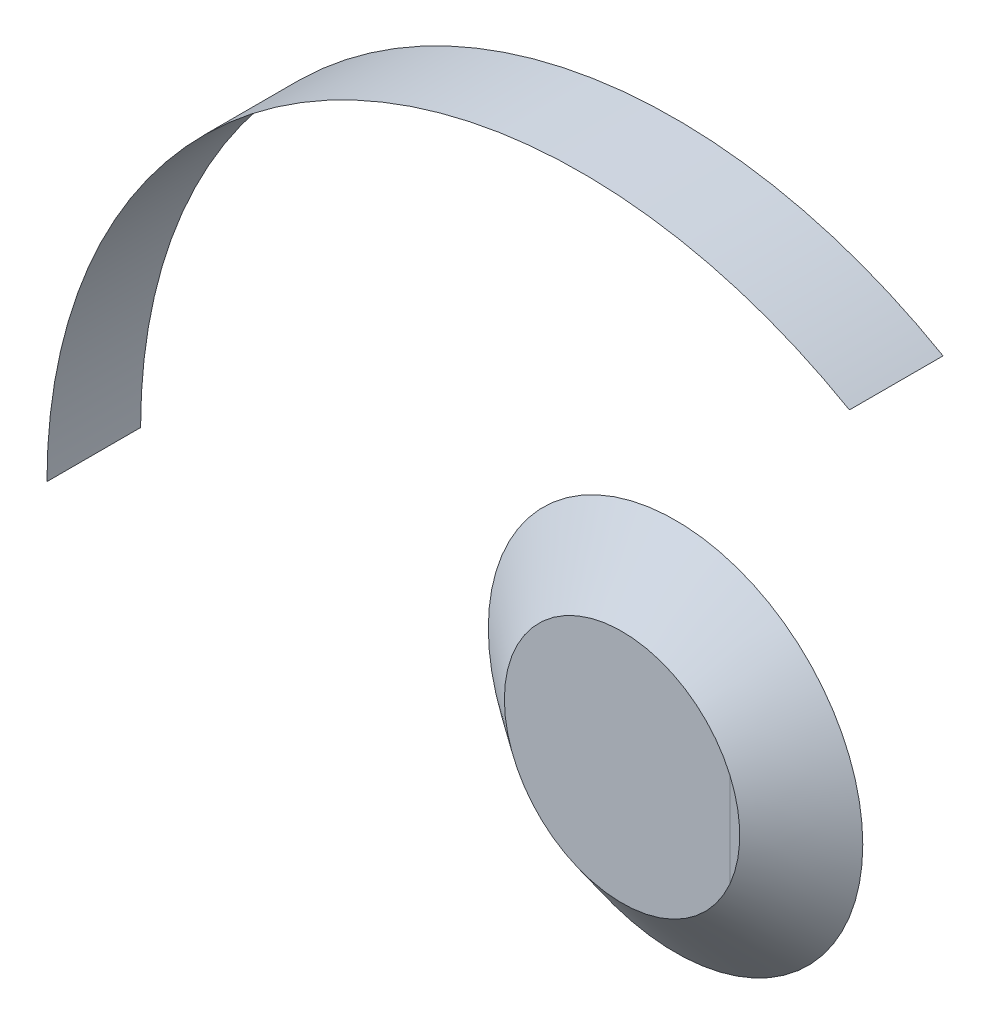
ISO-10303-21;
HEADER;
FILE_DESCRIPTION(('STEP AP214'),'2;1');
FILE_NAME('part.step','',(''),(''),'','','');
FILE_SCHEMA(('AUTOMOTIVE_DESIGN { 1 0 10303 214 1 1 1 1 }'));
ENDSEC;
DATA;
#1=APPLICATION_CONTEXT('core data for automotive mechanical design processes');
#2=APPLICATION_PROTOCOL_DEFINITION('international standard','automotive_design',2000,#1);
#3=PRODUCT_CONTEXT('',#1,'mechanical');
#4=PRODUCT('Part','Part','',(#3));
#5=PRODUCT_RELATED_PRODUCT_CATEGORY('part','',(#4));
#6=PRODUCT_DEFINITION_FORMATION('','',#4);
#7=PRODUCT_DEFINITION_CONTEXT('part definition',#1,'design');
#8=PRODUCT_DEFINITION('design','',#6,#7);
#9=PRODUCT_DEFINITION_SHAPE('','',#8);
#10=(LENGTH_UNIT() NAMED_UNIT(*) SI_UNIT(.MILLI.,.METRE.));
#11=(NAMED_UNIT(*) PLANE_ANGLE_UNIT() SI_UNIT($,.RADIAN.));
#12=(NAMED_UNIT(*) SI_UNIT($,.STERADIAN.) SOLID_ANGLE_UNIT());
#13=UNCERTAINTY_MEASURE_WITH_UNIT(LENGTH_MEASURE(1.E-05),#10,'distance_accuracy_value','');
#14=(GEOMETRIC_REPRESENTATION_CONTEXT(3) GLOBAL_UNCERTAINTY_ASSIGNED_CONTEXT((#13)) GLOBAL_UNIT_ASSIGNED_CONTEXT((#10,
#11,#12)) REPRESENTATION_CONTEXT('',''));
#15=CARTESIAN_POINT('',(0.,0.,0.));
#16=DIRECTION('',(0.,0.,1.));
#17=DIRECTION('',(1.,0.,0.));
#18=AXIS2_PLACEMENT_3D('',#15,#16,#17);
#19=CARTESIAN_POINT('',(0.,0.,0.));
#20=DIRECTION('',(0.,0.,1.));
#21=DIRECTION('',(1.,0.,0.));
#22=AXIS2_PLACEMENT_3D('',#19,#20,#21);
#23=CYLINDRICAL_SURFACE('',#22,200.);
#24=CARTESIAN_POINT('',(0.,0.,35.));
#25=DIRECTION('',(0.,0.,-1.));
#26=DIRECTION('',(-1.,0.,0.));
#27=AXIS2_PLACEMENT_3D('',#24,#25,#26);
#28=CIRCLE('',#27,200.);
#29=CARTESIAN_POINT('',(-200.,0.,35.));
#30=VERTEX_POINT('',#29);
#31=CARTESIAN_POINT('',(100.000000000001,173.205080756887,35.));
#32=VERTEX_POINT('',#31);
#33=EDGE_CURVE('E70',#30,#32,#28,.T.);
#34=ORIENTED_EDGE('',*,*,#33,.F.);
#35=DIRECTION('',(0.,0.,1.));
#36=VECTOR('',#35,1.);
#37=CARTESIAN_POINT('',(-200.,0.,0.));
#38=LINE('',#37,#36);
#39=CARTESIAN_POINT('',(-200.,0.,0.));
#40=VERTEX_POINT('',#39);
#41=EDGE_CURVE('E52',#40,#30,#38,.T.);
#42=ORIENTED_EDGE('',*,*,#41,.F.);
#43=CARTESIAN_POINT('',(0.,0.,0.));
#44=DIRECTION('',(0.,0.,-1.));
#45=DIRECTION('',(-1.,0.,0.));
#46=AXIS2_PLACEMENT_3D('',#43,#44,#45);
#47=CIRCLE('',#46,200.);
#48=CARTESIAN_POINT('',(100.000000000001,173.205080756887,0.));
#49=VERTEX_POINT('',#48);
#50=EDGE_CURVE('E58',#40,#49,#47,.T.);
#51=ORIENTED_EDGE('',*,*,#50,.T.);
#52=DIRECTION('',(0.,0.,1.));
#53=VECTOR('',#52,1.);
#54=CARTESIAN_POINT('',(100.000000000001,173.205080756887,0.));
#55=LINE('',#54,#53);
#56=EDGE_CURVE('E13',#49,#32,#55,.T.);
#57=ORIENTED_EDGE('',*,*,#56,.T.);
#58=EDGE_LOOP('',(#34,#42,#51,#57));
#59=FACE_BOUND('',#58,.T.);
#60=ADVANCED_FACE('F51',(#59),#23,.F.);
#61=OPEN_SHELL('',(#60));
#62=SHELL_BASED_SURFACE_MODEL('B2',(#61));
#63=CARTESIAN_POINT('',(0.,0.,20.));
#64=DIRECTION('',(0.,0.,1.));
#65=DIRECTION('',(1.,0.,0.));
#66=AXIS2_PLACEMENT_3D('',#63,#64,#65);
#67=PLANE('',#66);
#68=CARTESIAN_POINT('',(0.,0.,20.));
#69=DIRECTION('',(0.,0.,1.));
#70=DIRECTION('',(1.,0.,0.));
#71=AXIS2_PLACEMENT_3D('',#68,#69,#70);
#72=CIRCLE('',#71,44.);
#73=CARTESIAN_POINT('',(40.2883530194536,17.6875269888099,20.));
#74=VERTEX_POINT('',#73);
#75=CARTESIAN_POINT('',(40.2883530194536,-17.6875269888099,20.));
#76=VERTEX_POINT('',#75);
#77=EDGE_CURVE('E113',#74,#76,#72,.F.);
#78=ORIENTED_EDGE('',*,*,#77,.F.);
#79=DIRECTION('',(0.,-1.,0.));
#80=VECTOR('',#79,1.);
#81=CARTESIAN_POINT('',(40.2883530194536,70.0101,20.));
#82=LINE('',#81,#80);
#83=EDGE_CURVE('E49',#74,#76,#82,.T.);
#84=ORIENTED_EDGE('',*,*,#83,.T.);
#85=EDGE_LOOP('',(#78,#84));
#86=FACE_BOUND('',#85,.T.);
#87=ADVANCED_FACE('F95',(#86),#67,.T.);
#88=ORIENTED_EDGE('',*,*,#83,.F.);
#89=EDGE_CURVE('E105',#76,#74,#72,.F.);
#90=ORIENTED_EDGE('',*,*,#89,.F.);
#91=EDGE_LOOP('',(#88,#90));
#92=FACE_BOUND('',#91,.T.);
#93=ADVANCED_FACE('F120',(#92),#67,.T.);
#94=CARTESIAN_POINT('',(0.,0.,20.));
#95=DIRECTION('',(0.,0.,-1.));
#96=DIRECTION('',(-1.,0.,0.));
#97=AXIS2_PLACEMENT_3D('',#94,#95,#96);
#98=CONICAL_SURFACE('',#97,44.,0.915100700553361);
#99=ORIENTED_EDGE('',*,*,#89,.T.);
#100=ORIENTED_EDGE('',*,*,#77,.T.);
#101=EDGE_LOOP('',(#99,#100));
#102=FACE_BOUND('',#101,.T.);
#103=CARTESIAN_POINT('',(0.,0.,0.));
#104=DIRECTION('',(0.,0.,-1.));
#105=DIRECTION('',(-1.,0.,0.));
#106=AXIS2_PLACEMENT_3D('',#103,#104,#105);
#107=CIRCLE('',#106,70.);
#108=CARTESIAN_POINT('',(-70.,0.,0.));
#109=VERTEX_POINT('',#108);
#110=EDGE_CURVE('E118',#109,#109,#107,.T.);
#111=ORIENTED_EDGE('',*,*,#110,.F.);
#112=EDGE_LOOP('',(#111));
#113=FACE_BOUND('',#112,.T.);
#114=ADVANCED_FACE('F116',(#102,#113),#98,.T.);
#115=CARTESIAN_POINT('',(0.,0.,0.));
#116=DIRECTION('',(0.,0.,1.));
#117=DIRECTION('',(1.,0.,0.));
#118=AXIS2_PLACEMENT_3D('',#115,#116,#117);
#119=PLANE('',#118);
#120=ORIENTED_EDGE('',*,*,#110,.T.);
#121=EDGE_LOOP('',(#120));
#122=FACE_BOUND('',#121,.T.);
#123=ADVANCED_FACE('F97',(#122),#119,.F.);
#124=CLOSED_SHELL('',(#87,#93,#114,#123));
#125=MANIFOLD_SOLID_BREP('B7',#124);
#126=ADVANCED_BREP_SHAPE_REPRESENTATION('',(#18,#125),#14);
#127=MANIFOLD_SURFACE_SHAPE_REPRESENTATION('',(#18,#62),#14);
#128=SHAPE_REPRESENTATION('',(#18),#14);
#129=SHAPE_DEFINITION_REPRESENTATION(#9,#128);
#130=SHAPE_REPRESENTATION_RELATIONSHIP('','',#128,#126);
#131=SHAPE_REPRESENTATION_RELATIONSHIP('','',#128,#127);
ENDSEC;
END-ISO-10303-21;
